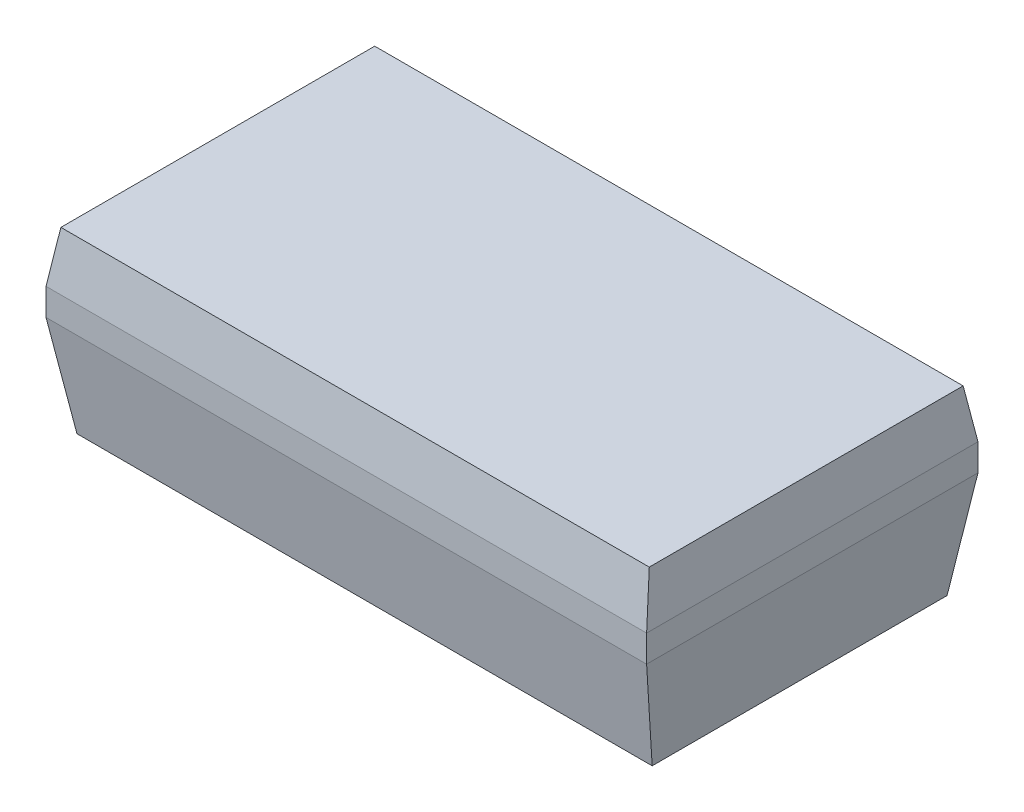
ISO-10303-21;
HEADER;
FILE_DESCRIPTION(('STEP AP214'),'2;1');
FILE_NAME('part.step','',(''),(''),'','','');
FILE_SCHEMA(('AUTOMOTIVE_DESIGN { 1 0 10303 214 1 1 1 1 }'));
ENDSEC;
DATA;
#1=APPLICATION_CONTEXT('core data for automotive mechanical design processes');
#2=APPLICATION_PROTOCOL_DEFINITION('international standard','automotive_design',2000,#1);
#3=PRODUCT_CONTEXT('',#1,'mechanical');
#4=PRODUCT('Part','Part','',(#3));
#5=PRODUCT_RELATED_PRODUCT_CATEGORY('part','',(#4));
#6=PRODUCT_DEFINITION_FORMATION('','',#4);
#7=PRODUCT_DEFINITION_CONTEXT('part definition',#1,'design');
#8=PRODUCT_DEFINITION('design','',#6,#7);
#9=PRODUCT_DEFINITION_SHAPE('','',#8);
#10=(LENGTH_UNIT() NAMED_UNIT(*) SI_UNIT(.MILLI.,.METRE.));
#11=(NAMED_UNIT(*) PLANE_ANGLE_UNIT() SI_UNIT($,.RADIAN.));
#12=(NAMED_UNIT(*) SI_UNIT($,.STERADIAN.) SOLID_ANGLE_UNIT());
#13=UNCERTAINTY_MEASURE_WITH_UNIT(LENGTH_MEASURE(1.E-05),#10,'distance_accuracy_value','');
#14=(GEOMETRIC_REPRESENTATION_CONTEXT(3) GLOBAL_UNCERTAINTY_ASSIGNED_CONTEXT((#13)) GLOBAL_UNIT_ASSIGNED_CONTEXT((#10,
#11,#12)) REPRESENTATION_CONTEXT('',''));
#15=CARTESIAN_POINT('',(0.,0.,0.));
#16=DIRECTION('',(0.,0.,1.));
#17=DIRECTION('',(1.,0.,0.));
#18=AXIS2_PLACEMENT_3D('',#15,#16,#17);
#19=CARTESIAN_POINT('',(0.,-0.63,0.));
#20=DIRECTION('',(0.,-1.,0.));
#21=DIRECTION('',(0.,0.,-1.));
#22=AXIS2_PLACEMENT_3D('',#19,#20,#21);
#23=PLANE('',#22);
#24=DIRECTION('',(1.,0.,0.));
#25=VECTOR('',#24,1.);
#26=CARTESIAN_POINT('',(-1.45,-0.629999999999951,-0.711836509645722));
#27=LINE('',#26,#25);
#28=CARTESIAN_POINT('',(1.3886077195488,-0.629999999999964,-0.71183650964593));
#29=VERTEX_POINT('',#28);
#30=CARTESIAN_POINT('',(-1.3886077195489,-0.629999999999976,-0.71183650964593));
#31=VERTEX_POINT('',#30);
#32=EDGE_CURVE('E94',#29,#31,#27,.F.);
#33=ORIENTED_EDGE('',*,*,#32,.F.);
#34=DIRECTION('',(0.,0.,1.));
#35=VECTOR('',#34,1.);
#36=CARTESIAN_POINT('',(1.38860771954861,-0.629999999999952,-0.8));
#37=LINE('',#36,#35);
#38=CARTESIAN_POINT('',(1.3886077195489,-0.629999999999963,0.711836509645861));
#39=VERTEX_POINT('',#38);
#40=EDGE_CURVE('E80',#39,#29,#37,.F.);
#41=ORIENTED_EDGE('',*,*,#40,.F.);
#42=DIRECTION('',(1.,0.,0.));
#43=VECTOR('',#42,1.);
#44=CARTESIAN_POINT('',(1.45,-0.629999999999951,0.711836509645722));
#45=LINE('',#44,#43);
#46=CARTESIAN_POINT('',(-1.3886077195489,-0.629999999999976,0.71183650964593));
#47=VERTEX_POINT('',#46);
#48=EDGE_CURVE('E86',#47,#39,#45,.T.);
#49=ORIENTED_EDGE('',*,*,#48,.F.);
#50=DIRECTION('',(0.,0.,-1.));
#51=VECTOR('',#50,1.);
#52=CARTESIAN_POINT('',(-1.388607719549,-0.63,0.));
#53=LINE('',#52,#51);
#54=EDGE_CURVE('E20',#47,#31,#53,.T.);
#55=ORIENTED_EDGE('',*,*,#54,.T.);
#56=EDGE_LOOP('',(#33,#41,#49,#55));
#57=FACE_BOUND('',#56,.T.);
#58=ADVANCED_FACE('F17',(#57),#23,.T.);
#59=CARTESIAN_POINT('',(1.45,-0.13,0.8));
#60=DIRECTION('',(0.,-0.173648177667033,0.98480775301219));
#61=DIRECTION('',(0.,-0.98480775301219,-0.173648177667033));
#62=AXIS2_PLACEMENT_3D('',#59,#60,#61);
#63=PLANE('',#62);
#64=DIRECTION('',(-0.120044758075973,-0.977686096633987,-0.172392437499678));
#65=VECTOR('',#64,1.);
#66=CARTESIAN_POINT('',(1.45,-0.13,0.8));
#67=LINE('',#66,#65);
#68=CARTESIAN_POINT('',(1.45,-0.13,0.8));
#69=VERTEX_POINT('',#68);
#70=EDGE_CURVE('E88',#69,#39,#67,.T.);
#71=ORIENTED_EDGE('',*,*,#70,.F.);
#72=DIRECTION('',(1.,0.,0.));
#73=VECTOR('',#72,1.);
#74=CARTESIAN_POINT('',(-1.45,-0.13,0.8));
#75=LINE('',#74,#73);
#76=CARTESIAN_POINT('',(-1.45,-0.13,0.8));
#77=VERTEX_POINT('',#76);
#78=EDGE_CURVE('E111',#77,#69,#75,.T.);
#79=ORIENTED_EDGE('',*,*,#78,.F.);
#80=DIRECTION('',(-0.120044758075973,0.977686096633987,0.172392437499678));
#81=VECTOR('',#80,1.);
#82=CARTESIAN_POINT('',(-1.38860771954861,-0.629999999999952,0.711836509646));
#83=LINE('',#82,#81);
#84=EDGE_CURVE('E91',#47,#77,#83,.T.);
#85=ORIENTED_EDGE('',*,*,#84,.F.);
#86=ORIENTED_EDGE('',*,*,#48,.T.);
#87=EDGE_LOOP('',(#71,#79,#85,#86));
#88=FACE_BOUND('',#87,.T.);
#89=ADVANCED_FACE('F87',(#88),#63,.T.);
#90=CARTESIAN_POINT('',(1.45,-0.13,-0.8));
#91=DIRECTION('',(0.992546151641335,-0.121869343405041,0.));
#92=DIRECTION('',(0.121869343405041,0.992546151641335,0.));
#93=AXIS2_PLACEMENT_3D('',#90,#91,#92);
#94=PLANE('',#93);
#95=DIRECTION('',(-0.120044758075205,-0.977686096633985,0.172392437500221));
#96=VECTOR('',#95,1.);
#97=CARTESIAN_POINT('',(1.45,-0.13,-0.8));
#98=LINE('',#97,#96);
#99=CARTESIAN_POINT('',(1.45,-0.13,-0.8));
#100=VERTEX_POINT('',#99);
#101=EDGE_CURVE('E96',#100,#29,#98,.T.);
#102=ORIENTED_EDGE('',*,*,#101,.F.);
#103=DIRECTION('',(0.,0.,-1.));
#104=VECTOR('',#103,1.);
#105=CARTESIAN_POINT('',(1.45,-0.13,0.8));
#106=LINE('',#105,#104);
#107=EDGE_CURVE('E101',#69,#100,#106,.T.);
#108=ORIENTED_EDGE('',*,*,#107,.F.);
#109=ORIENTED_EDGE('',*,*,#70,.T.);
#110=ORIENTED_EDGE('',*,*,#40,.T.);
#111=EDGE_LOOP('',(#102,#108,#109,#110));
#112=FACE_BOUND('',#111,.T.);
#113=ADVANCED_FACE('F99',(#112),#94,.T.);
#114=CARTESIAN_POINT('',(-1.45,-0.13,-0.8));
#115=DIRECTION('',(0.,-0.173648177667033,-0.98480775301219));
#116=DIRECTION('',(0.,0.98480775301219,-0.173648177667033));
#117=AXIS2_PLACEMENT_3D('',#114,#115,#116);
#118=PLANE('',#117);
#119=DIRECTION('',(0.120044758075973,-0.977686096633987,0.172392437499678));
#120=VECTOR('',#119,1.);
#121=CARTESIAN_POINT('',(-1.45,-0.13,-0.8));
#122=LINE('',#121,#120);
#123=CARTESIAN_POINT('',(-1.45,-0.13,-0.8));
#124=VERTEX_POINT('',#123);
#125=EDGE_CURVE('E107',#124,#31,#122,.T.);
#126=ORIENTED_EDGE('',*,*,#125,.F.);
#127=DIRECTION('',(-1.,0.,0.));
#128=VECTOR('',#127,1.);
#129=CARTESIAN_POINT('',(1.45,-0.13,-0.8));
#130=LINE('',#129,#128);
#131=EDGE_CURVE('E119',#100,#124,#130,.T.);
#132=ORIENTED_EDGE('',*,*,#131,.F.);
#133=ORIENTED_EDGE('',*,*,#101,.T.);
#134=ORIENTED_EDGE('',*,*,#32,.T.);
#135=EDGE_LOOP('',(#126,#132,#133,#134));
#136=FACE_BOUND('',#135,.T.);
#137=ADVANCED_FACE('F185',(#136),#118,.T.);
#138=CARTESIAN_POINT('',(-1.45,-0.13,0.8));
#139=DIRECTION('',(-0.992546151641335,-0.121869343405041,0.));
#140=DIRECTION('',(0.121869343405041,-0.992546151641335,0.));
#141=AXIS2_PLACEMENT_3D('',#138,#139,#140);
#142=PLANE('',#141);
#143=ORIENTED_EDGE('',*,*,#84,.T.);
#144=DIRECTION('',(0.,0.,1.));
#145=VECTOR('',#144,1.);
#146=CARTESIAN_POINT('',(-1.45,-0.13,-0.8));
#147=LINE('',#146,#145);
#148=EDGE_CURVE('E125',#124,#77,#147,.T.);
#149=ORIENTED_EDGE('',*,*,#148,.F.);
#150=ORIENTED_EDGE('',*,*,#125,.T.);
#151=ORIENTED_EDGE('',*,*,#54,.F.);
#152=EDGE_LOOP('',(#143,#149,#150,#151));
#153=FACE_BOUND('',#152,.T.);
#154=ADVANCED_FACE('F187',(#153),#142,.T.);
#155=CARTESIAN_POINT('',(-1.45,0.,0.8));
#156=DIRECTION('',(0.,0.,1.));
#157=DIRECTION('',(1.,0.,0.));
#158=AXIS2_PLACEMENT_3D('',#155,#156,#157);
#159=PLANE('',#158);
#160=DIRECTION('',(0.,1.,0.));
#161=VECTOR('',#160,1.);
#162=CARTESIAN_POINT('',(1.45,0.,0.8));
#163=LINE('',#162,#161);
#164=CARTESIAN_POINT('',(1.45,0.,0.8));
#165=VERTEX_POINT('',#164);
#166=EDGE_CURVE('E113',#165,#69,#163,.F.);
#167=ORIENTED_EDGE('',*,*,#166,.F.);
#168=DIRECTION('',(1.,0.,0.));
#169=VECTOR('',#168,1.);
#170=CARTESIAN_POINT('',(-1.45,0.,0.8));
#171=LINE('',#170,#169);
#172=CARTESIAN_POINT('',(-1.45,0.,0.8));
#173=VERTEX_POINT('',#172);
#174=EDGE_CURVE('E131',#173,#165,#171,.T.);
#175=ORIENTED_EDGE('',*,*,#174,.F.);
#176=DIRECTION('',(0.,1.,0.));
#177=VECTOR('',#176,1.);
#178=CARTESIAN_POINT('',(-1.45,0.,0.8));
#179=LINE('',#178,#177);
#180=EDGE_CURVE('E128',#77,#173,#179,.T.);
#181=ORIENTED_EDGE('',*,*,#180,.F.);
#182=ORIENTED_EDGE('',*,*,#78,.T.);
#183=EDGE_LOOP('',(#167,#175,#181,#182));
#184=FACE_BOUND('',#183,.T.);
#185=ADVANCED_FACE('F182',(#184),#159,.T.);
#186=CARTESIAN_POINT('',(1.45,0.,0.8));
#187=DIRECTION('',(1.,0.,0.));
#188=DIRECTION('',(0.,0.,-1.));
#189=AXIS2_PLACEMENT_3D('',#186,#187,#188);
#190=PLANE('',#189);
#191=DIRECTION('',(0.,1.,0.));
#192=VECTOR('',#191,1.);
#193=CARTESIAN_POINT('',(1.45,0.,-0.8));
#194=LINE('',#193,#192);
#195=CARTESIAN_POINT('',(1.45,0.,-0.8));
#196=VERTEX_POINT('',#195);
#197=EDGE_CURVE('E116',#196,#100,#194,.F.);
#198=ORIENTED_EDGE('',*,*,#197,.F.);
#199=DIRECTION('',(0.,0.,1.));
#200=VECTOR('',#199,1.);
#201=CARTESIAN_POINT('',(1.45,0.,0.8));
#202=LINE('',#201,#200);
#203=EDGE_CURVE('E137',#165,#196,#202,.F.);
#204=ORIENTED_EDGE('',*,*,#203,.F.);
#205=ORIENTED_EDGE('',*,*,#166,.T.);
#206=ORIENTED_EDGE('',*,*,#107,.T.);
#207=EDGE_LOOP('',(#198,#204,#205,#206));
#208=FACE_BOUND('',#207,.T.);
#209=ADVANCED_FACE('F183',(#208),#190,.T.);
#210=CARTESIAN_POINT('',(1.45,0.,-0.8));
#211=DIRECTION('',(0.,0.,-1.));
#212=DIRECTION('',(-1.,0.,0.));
#213=AXIS2_PLACEMENT_3D('',#210,#211,#212);
#214=PLANE('',#213);
#215=DIRECTION('',(0.,1.,0.));
#216=VECTOR('',#215,1.);
#217=CARTESIAN_POINT('',(-1.45,0.,-0.8));
#218=LINE('',#217,#216);
#219=CARTESIAN_POINT('',(-1.45,0.,-0.8));
#220=VERTEX_POINT('',#219);
#221=EDGE_CURVE('E122',#220,#124,#218,.F.);
#222=ORIENTED_EDGE('',*,*,#221,.F.);
#223=DIRECTION('',(1.,0.,0.));
#224=VECTOR('',#223,1.);
#225=CARTESIAN_POINT('',(1.45,0.,-0.8));
#226=LINE('',#225,#224);
#227=EDGE_CURVE('E143',#196,#220,#226,.F.);
#228=ORIENTED_EDGE('',*,*,#227,.F.);
#229=ORIENTED_EDGE('',*,*,#197,.T.);
#230=ORIENTED_EDGE('',*,*,#131,.T.);
#231=EDGE_LOOP('',(#222,#228,#229,#230));
#232=FACE_BOUND('',#231,.T.);
#233=ADVANCED_FACE('F170',(#232),#214,.T.);
#234=CARTESIAN_POINT('',(-1.45,0.,-0.8));
#235=DIRECTION('',(-1.,0.,0.));
#236=DIRECTION('',(0.,0.,1.));
#237=AXIS2_PLACEMENT_3D('',#234,#235,#236);
#238=PLANE('',#237);
#239=ORIENTED_EDGE('',*,*,#180,.T.);
#240=DIRECTION('',(0.,0.,1.));
#241=VECTOR('',#240,1.);
#242=CARTESIAN_POINT('',(-1.45,0.,-0.8));
#243=LINE('',#242,#241);
#244=EDGE_CURVE('E149',#220,#173,#243,.T.);
#245=ORIENTED_EDGE('',*,*,#244,.F.);
#246=ORIENTED_EDGE('',*,*,#221,.T.);
#247=ORIENTED_EDGE('',*,*,#148,.T.);
#248=EDGE_LOOP('',(#239,#245,#246,#247));
#249=FACE_BOUND('',#248,.T.);
#250=ADVANCED_FACE('F174',(#249),#238,.T.);
#251=CARTESIAN_POINT('',(-1.45,0.,0.8));
#252=DIRECTION('',(0.,0.173648177667033,0.98480775301219));
#253=DIRECTION('',(0.,-0.98480775301219,0.173648177667033));
#254=AXIS2_PLACEMENT_3D('',#251,#252,#253);
#255=PLANE('',#254);
#256=DIRECTION('',(0.120044758075966,0.977686096633939,-0.17239243749995));
#257=VECTOR('',#256,1.);
#258=CARTESIAN_POINT('',(-1.45,0.,0.8));
#259=LINE('',#258,#257);
#260=CARTESIAN_POINT('',(-1.42053170538308,0.240000000000005,0.757681524629972));
#261=VERTEX_POINT('',#260);
#262=EDGE_CURVE('E145',#173,#261,#259,.T.);
#263=ORIENTED_EDGE('',*,*,#262,.F.);
#264=ORIENTED_EDGE('',*,*,#174,.T.);
#265=DIRECTION('',(0.120044758075966,-0.977686096633939,0.17239243749995));
#266=VECTOR('',#265,1.);
#267=CARTESIAN_POINT('',(1.42053170538332,0.24000000000004,0.75768152463));
#268=LINE('',#267,#266);
#269=CARTESIAN_POINT('',(1.42053170538308,0.240000000000005,0.757681524629972));
#270=VERTEX_POINT('',#269);
#271=EDGE_CURVE('E134',#270,#165,#268,.T.);
#272=ORIENTED_EDGE('',*,*,#271,.F.);
#273=DIRECTION('',(1.,0.,0.));
#274=VECTOR('',#273,1.);
#275=CARTESIAN_POINT('',(0.,0.24,0.75768152463));
#276=LINE('',#275,#274);
#277=EDGE_CURVE('E152',#261,#270,#276,.T.);
#278=ORIENTED_EDGE('',*,*,#277,.F.);
#279=EDGE_LOOP('',(#263,#264,#272,#278));
#280=FACE_BOUND('',#279,.T.);
#281=ADVANCED_FACE('F180',(#280),#255,.T.);
#282=CARTESIAN_POINT('',(1.45,0.,0.8));
#283=DIRECTION('',(0.992546151641335,0.121869343405041,0.));
#284=DIRECTION('',(-0.121869343405041,0.992546151641335,0.));
#285=AXIS2_PLACEMENT_3D('',#282,#283,#284);
#286=PLANE('',#285);
#287=ORIENTED_EDGE('',*,*,#271,.T.);
#288=ORIENTED_EDGE('',*,*,#203,.T.);
#289=DIRECTION('',(0.120044758077286,-0.977686096633737,-0.172392437500177));
#290=VECTOR('',#289,1.);
#291=CARTESIAN_POINT('',(1.420531705383,0.23999999999999,-0.757681524629944));
#292=LINE('',#291,#290);
#293=CARTESIAN_POINT('',(1.42053170538316,0.240000000000017,-0.757681524629986));
#294=VERTEX_POINT('',#293);
#295=EDGE_CURVE('E140',#294,#196,#292,.T.);
#296=ORIENTED_EDGE('',*,*,#295,.F.);
#297=DIRECTION('',(0.,0.,1.));
#298=VECTOR('',#297,1.);
#299=CARTESIAN_POINT('',(1.420531705383,0.24,0.));
#300=LINE('',#299,#298);
#301=EDGE_CURVE('E155',#270,#294,#300,.F.);
#302=ORIENTED_EDGE('',*,*,#301,.F.);
#303=EDGE_LOOP('',(#287,#288,#296,#302));
#304=FACE_BOUND('',#303,.T.);
#305=ADVANCED_FACE('F166',(#304),#286,.T.);
#306=CARTESIAN_POINT('',(1.45,0.,-0.8));
#307=DIRECTION('',(0.,0.173648177667033,-0.98480775301219));
#308=DIRECTION('',(0.,0.98480775301219,0.173648177667033));
#309=AXIS2_PLACEMENT_3D('',#306,#307,#308);
#310=PLANE('',#309);
#311=ORIENTED_EDGE('',*,*,#295,.T.);
#312=ORIENTED_EDGE('',*,*,#227,.T.);
#313=DIRECTION('',(-0.120044758075966,-0.977686096633939,-0.17239243749995));
#314=VECTOR('',#313,1.);
#315=CARTESIAN_POINT('',(-1.42053170538332,0.24000000000004,-0.75768152463));
#316=LINE('',#315,#314);
#317=CARTESIAN_POINT('',(-1.42053170538308,0.240000000000005,-0.757681524629972));
#318=VERTEX_POINT('',#317);
#319=EDGE_CURVE('E35',#318,#220,#316,.T.);
#320=ORIENTED_EDGE('',*,*,#319,.F.);
#321=DIRECTION('',(1.,0.,0.));
#322=VECTOR('',#321,1.);
#323=CARTESIAN_POINT('',(0.,0.24,-0.75768152463));
#324=LINE('',#323,#322);
#325=EDGE_CURVE('E26',#294,#318,#324,.F.);
#326=ORIENTED_EDGE('',*,*,#325,.F.);
#327=EDGE_LOOP('',(#311,#312,#320,#326));
#328=FACE_BOUND('',#327,.T.);
#329=ADVANCED_FACE('F162',(#328),#310,.T.);
#330=CARTESIAN_POINT('',(-1.45,0.,-0.8));
#331=DIRECTION('',(-0.992546151641335,0.121869343405041,0.));
#332=DIRECTION('',(-0.121869343405041,-0.992546151641335,0.));
#333=AXIS2_PLACEMENT_3D('',#330,#331,#332);
#334=PLANE('',#333);
#335=ORIENTED_EDGE('',*,*,#319,.T.);
#336=ORIENTED_EDGE('',*,*,#244,.T.);
#337=ORIENTED_EDGE('',*,*,#262,.T.);
#338=DIRECTION('',(0.,0.,1.));
#339=VECTOR('',#338,1.);
#340=CARTESIAN_POINT('',(-1.420531705383,0.24,0.));
#341=LINE('',#340,#339);
#342=EDGE_CURVE('E11',#318,#261,#341,.T.);
#343=ORIENTED_EDGE('',*,*,#342,.F.);
#344=EDGE_LOOP('',(#335,#336,#337,#343));
#345=FACE_BOUND('',#344,.T.);
#346=ADVANCED_FACE('F177',(#345),#334,.T.);
#347=CARTESIAN_POINT('',(0.,0.24,0.));
#348=DIRECTION('',(0.,1.,0.));
#349=DIRECTION('',(0.,0.,1.));
#350=AXIS2_PLACEMENT_3D('',#347,#348,#349);
#351=PLANE('',#350);
#352=ORIENTED_EDGE('',*,*,#325,.T.);
#353=ORIENTED_EDGE('',*,*,#342,.T.);
#354=ORIENTED_EDGE('',*,*,#277,.T.);
#355=ORIENTED_EDGE('',*,*,#301,.T.);
#356=EDGE_LOOP('',(#352,#353,#354,#355));
#357=FACE_BOUND('',#356,.T.);
#358=ADVANCED_FACE('F160',(#357),#351,.T.);
#359=CLOSED_SHELL('',(#58,#89,#113,#137,#154,#185,#209,#233,#250,#281,#305,#329,#346,#358));
#360=MANIFOLD_SOLID_BREP('B1',#359);
#361=ADVANCED_BREP_SHAPE_REPRESENTATION('',(#18,#360),#14);
#362=SHAPE_DEFINITION_REPRESENTATION(#9,#361);
ENDSEC;
END-ISO-10303-21;
